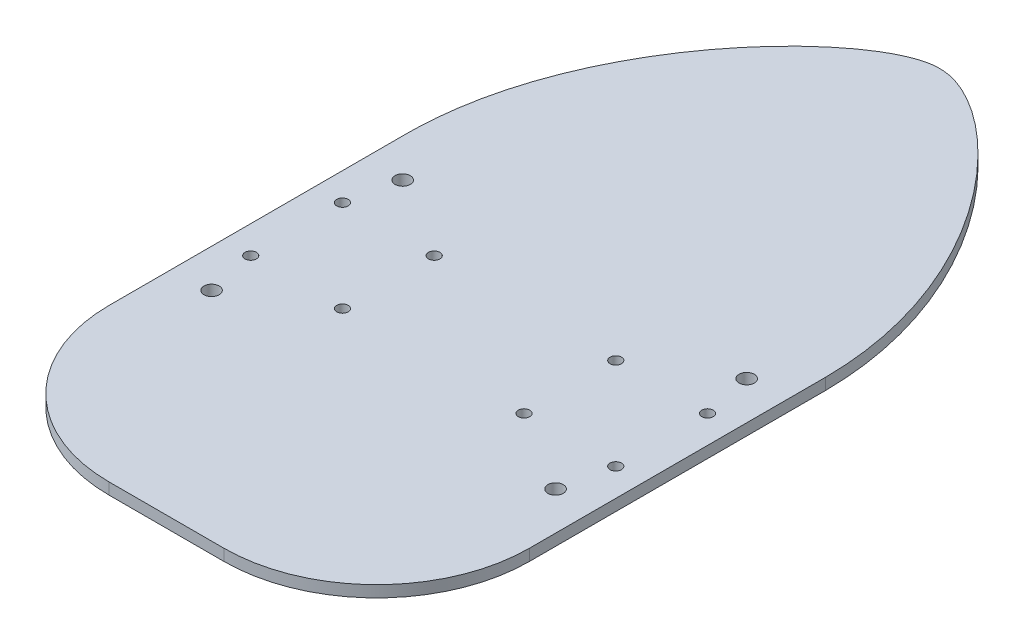
ISO-10303-21;
HEADER;
FILE_DESCRIPTION(('STEP AP214'),'2;1');
FILE_NAME('part.step','',(''),(''),'','','');
FILE_SCHEMA(('AUTOMOTIVE_DESIGN { 1 0 10303 214 1 1 1 1 }'));
ENDSEC;
DATA;
#1=APPLICATION_CONTEXT('core data for automotive mechanical design processes');
#2=APPLICATION_PROTOCOL_DEFINITION('international standard','automotive_design',2000,#1);
#3=PRODUCT_CONTEXT('',#1,'mechanical');
#4=PRODUCT('Part','Part','',(#3));
#5=PRODUCT_RELATED_PRODUCT_CATEGORY('part','',(#4));
#6=PRODUCT_DEFINITION_FORMATION('','',#4);
#7=PRODUCT_DEFINITION_CONTEXT('part definition',#1,'design');
#8=PRODUCT_DEFINITION('design','',#6,#7);
#9=PRODUCT_DEFINITION_SHAPE('','',#8);
#10=(LENGTH_UNIT() NAMED_UNIT(*) SI_UNIT(.MILLI.,.METRE.));
#11=(NAMED_UNIT(*) PLANE_ANGLE_UNIT() SI_UNIT($,.RADIAN.));
#12=(NAMED_UNIT(*) SI_UNIT($,.STERADIAN.) SOLID_ANGLE_UNIT());
#13=UNCERTAINTY_MEASURE_WITH_UNIT(LENGTH_MEASURE(1.E-05),#10,'distance_accuracy_value','');
#14=(GEOMETRIC_REPRESENTATION_CONTEXT(3) GLOBAL_UNCERTAINTY_ASSIGNED_CONTEXT((#13)) GLOBAL_UNIT_ASSIGNED_CONTEXT((#10,
#11,#12)) REPRESENTATION_CONTEXT('',''));
#15=CARTESIAN_POINT('',(0.,0.,0.));
#16=DIRECTION('',(0.,0.,1.));
#17=DIRECTION('',(1.,0.,0.));
#18=AXIS2_PLACEMENT_3D('',#15,#16,#17);
#19=CARTESIAN_POINT('',(-3.00000000000007,-7.42226979040567,-223.6));
#20=DIRECTION('',(-1.,0.,0.));
#21=DIRECTION('',(0.,0.,1.));
#22=AXIS2_PLACEMENT_3D('',#19,#20,#21);
#23=PLANE('',#22);
#24=DIRECTION('',(0.,-1.,0.));
#25=VECTOR('',#24,1.);
#26=CARTESIAN_POINT('',(-3.00000000000007,-7.42226979040567,-60.));
#27=LINE('',#26,#25);
#28=CARTESIAN_POINT('',(-3.00000000000007,-7.42226979040567,-60.));
#29=VERTEX_POINT('',#28);
#30=CARTESIAN_POINT('',(-3.00000000000007,-10.4222697904057,-60.));
#31=VERTEX_POINT('',#30);
#32=EDGE_CURVE('E119',#29,#31,#27,.T.);
#33=ORIENTED_EDGE('',*,*,#32,.T.);
#34=DIRECTION('',(0.,0.,1.));
#35=VECTOR('',#34,1.);
#36=CARTESIAN_POINT('',(-3.00000000000007,-10.4222697904057,-223.6));
#37=LINE('',#36,#35);
#38=CARTESIAN_POINT('',(-3.00000000000007,-10.4222697904057,-137.451520334084));
#39=VERTEX_POINT('',#38);
#40=EDGE_CURVE('E158',#39,#31,#37,.T.);
#41=ORIENTED_EDGE('',*,*,#40,.F.);
#42=DIRECTION('',(0.,-1.,0.));
#43=VECTOR('',#42,1.);
#44=CARTESIAN_POINT('',(-3.00000000000007,-7.42226979040567,-137.451520334084));
#45=LINE('',#44,#43);
#46=CARTESIAN_POINT('',(-3.00000000000007,-7.42226979040567,-137.451520334084));
#47=VERTEX_POINT('',#46);
#48=EDGE_CURVE('E129',#47,#39,#45,.T.);
#49=ORIENTED_EDGE('',*,*,#48,.F.);
#50=DIRECTION('',(0.,0.,1.));
#51=VECTOR('',#50,1.);
#52=CARTESIAN_POINT('',(-3.00000000000007,-7.42226979040567,-223.6));
#53=LINE('',#52,#51);
#54=EDGE_CURVE('E42',#47,#29,#53,.T.);
#55=ORIENTED_EDGE('',*,*,#54,.T.);
#56=EDGE_LOOP('',(#33,#41,#49,#55));
#57=FACE_BOUND('',#56,.T.);
#58=ADVANCED_FACE('F34',(#57),#23,.F.);
#59=CARTESIAN_POINT('',(-3.00000000000007,-7.42226979040567,-223.6));
#60=DIRECTION('',(0.,1.,0.));
#61=DIRECTION('',(-1.,0.,0.));
#62=AXIS2_PLACEMENT_3D('',#59,#60,#61);
#63=PLANE('',#62);
#64=CARTESIAN_POINT('',(-105.75,-7.42226979040567,-89.7999999999999));
#65=DIRECTION('',(0.,-1.,0.));
#66=DIRECTION('',(0.,0.,-1.));
#67=AXIS2_PLACEMENT_3D('',#64,#65,#66);
#68=CIRCLE('',#67,1.5);
#69=CARTESIAN_POINT('',(-105.75,-7.42226979040567,-91.2999999999999));
#70=VERTEX_POINT('',#69);
#71=EDGE_CURVE('E227',#70,#70,#68,.T.);
#72=ORIENTED_EDGE('',*,*,#71,.T.);
#73=EDGE_LOOP('',(#72));
#74=FACE_BOUND('',#73,.T.);
#75=CARTESIAN_POINT('',(-105.75,-7.42226979040567,-113.8));
#76=DIRECTION('',(0.,-1.,0.));
#77=DIRECTION('',(0.,0.,-1.));
#78=AXIS2_PLACEMENT_3D('',#75,#76,#77);
#79=CIRCLE('',#78,1.5);
#80=CARTESIAN_POINT('',(-105.75,-7.42226979040567,-115.3));
#81=VERTEX_POINT('',#80);
#82=EDGE_CURVE('E237',#81,#81,#79,.T.);
#83=ORIENTED_EDGE('',*,*,#82,.T.);
#84=EDGE_LOOP('',(#83));
#85=FACE_BOUND('',#84,.T.);
#86=CARTESIAN_POINT('',(-81.7500000000001,-7.42226979040567,-113.8));
#87=DIRECTION('',(0.,-1.,0.));
#88=DIRECTION('',(0.,0.,-1.));
#89=AXIS2_PLACEMENT_3D('',#86,#87,#88);
#90=CIRCLE('',#89,1.5);
#91=CARTESIAN_POINT('',(-81.7500000000001,-7.42226979040567,-115.3));
#92=VERTEX_POINT('',#91);
#93=EDGE_CURVE('E243',#92,#92,#90,.T.);
#94=ORIENTED_EDGE('',*,*,#93,.T.);
#95=EDGE_LOOP('',(#94));
#96=FACE_BOUND('',#95,.T.);
#97=CARTESIAN_POINT('',(-81.75,-7.42226979040567,-89.8));
#98=DIRECTION('',(0.,-1.,0.));
#99=DIRECTION('',(0.,0.,-1.));
#100=AXIS2_PLACEMENT_3D('',#97,#98,#99);
#101=CIRCLE('',#100,1.5);
#102=CARTESIAN_POINT('',(-81.75,-7.42226979040567,-91.3));
#103=VERTEX_POINT('',#102);
#104=EDGE_CURVE('E249',#103,#103,#101,.T.);
#105=ORIENTED_EDGE('',*,*,#104,.T.);
#106=EDGE_LOOP('',(#105));
#107=FACE_BOUND('',#106,.T.);
#108=CARTESIAN_POINT('',(-34.25,-7.42226979040567,-89.7999999999999));
#109=DIRECTION('',(0.,-1.,0.));
#110=DIRECTION('',(0.,0.,-1.));
#111=AXIS2_PLACEMENT_3D('',#108,#109,#110);
#112=CIRCLE('',#111,1.5);
#113=CARTESIAN_POINT('',(-34.25,-7.42226979040567,-91.2999999999999));
#114=VERTEX_POINT('',#113);
#115=EDGE_CURVE('E255',#114,#114,#112,.T.);
#116=ORIENTED_EDGE('',*,*,#115,.T.);
#117=EDGE_LOOP('',(#116));
#118=FACE_BOUND('',#117,.T.);
#119=CARTESIAN_POINT('',(-34.25,-7.42226979040567,-113.8));
#120=DIRECTION('',(0.,-1.,0.));
#121=DIRECTION('',(0.,0.,-1.));
#122=AXIS2_PLACEMENT_3D('',#119,#120,#121);
#123=CIRCLE('',#122,1.5);
#124=CARTESIAN_POINT('',(-34.25,-7.42226979040567,-115.3));
#125=VERTEX_POINT('',#124);
#126=EDGE_CURVE('E261',#125,#125,#123,.T.);
#127=ORIENTED_EDGE('',*,*,#126,.T.);
#128=EDGE_LOOP('',(#127));
#129=FACE_BOUND('',#128,.T.);
#130=CARTESIAN_POINT('',(-10.25,-7.42226979040567,-113.8));
#131=DIRECTION('',(0.,-1.,0.));
#132=DIRECTION('',(0.,0.,-1.));
#133=AXIS2_PLACEMENT_3D('',#130,#131,#132);
#134=CIRCLE('',#133,1.5);
#135=CARTESIAN_POINT('',(-10.25,-7.42226979040567,-115.3));
#136=VERTEX_POINT('',#135);
#137=EDGE_CURVE('E267',#136,#136,#134,.T.);
#138=ORIENTED_EDGE('',*,*,#137,.T.);
#139=EDGE_LOOP('',(#138));
#140=FACE_BOUND('',#139,.T.);
#141=CARTESIAN_POINT('',(-10.25,-7.42226979040567,-89.7999999999999));
#142=DIRECTION('',(0.,-1.,0.));
#143=DIRECTION('',(0.,0.,-1.));
#144=AXIS2_PLACEMENT_3D('',#141,#142,#143);
#145=CIRCLE('',#144,1.5);
#146=CARTESIAN_POINT('',(-10.25,-7.42226979040567,-91.2999999999999));
#147=VERTEX_POINT('',#146);
#148=EDGE_CURVE('E273',#147,#147,#145,.T.);
#149=ORIENTED_EDGE('',*,*,#148,.T.);
#150=EDGE_LOOP('',(#149));
#151=FACE_BOUND('',#150,.T.);
#152=CARTESIAN_POINT('',(-103.,-7.42226979040567,-76.8));
#153=DIRECTION('',(0.,-1.,0.));
#154=DIRECTION('',(1.,0.,0.));
#155=AXIS2_PLACEMENT_3D('',#152,#153,#154);
#156=CIRCLE('',#155,2.);
#157=CARTESIAN_POINT('',(-101.,-7.42226979040567,-76.8));
#158=VERTEX_POINT('',#157);
#159=EDGE_CURVE('E277',#158,#158,#156,.T.);
#160=ORIENTED_EDGE('',*,*,#159,.T.);
#161=EDGE_LOOP('',(#160));
#162=FACE_BOUND('',#161,.T.);
#163=CARTESIAN_POINT('',(-103.,-7.42226979040567,-126.8));
#164=DIRECTION('',(0.,-1.,0.));
#165=DIRECTION('',(1.,0.,0.));
#166=AXIS2_PLACEMENT_3D('',#163,#164,#165);
#167=CIRCLE('',#166,2.);
#168=CARTESIAN_POINT('',(-101.,-7.42226979040567,-126.8));
#169=VERTEX_POINT('',#168);
#170=EDGE_CURVE('E283',#169,#169,#167,.T.);
#171=ORIENTED_EDGE('',*,*,#170,.T.);
#172=EDGE_LOOP('',(#171));
#173=FACE_BOUND('',#172,.T.);
#174=CARTESIAN_POINT('',(-13.0000000000001,-7.42226979040567,-76.8));
#175=DIRECTION('',(0.,-1.,0.));
#176=DIRECTION('',(1.,0.,0.));
#177=AXIS2_PLACEMENT_3D('',#174,#175,#176);
#178=CIRCLE('',#177,1.99999999999999);
#179=CARTESIAN_POINT('',(-11.0000000000001,-7.42226979040567,-76.8));
#180=VERTEX_POINT('',#179);
#181=EDGE_CURVE('E289',#180,#180,#178,.T.);
#182=ORIENTED_EDGE('',*,*,#181,.T.);
#183=EDGE_LOOP('',(#182));
#184=FACE_BOUND('',#183,.T.);
#185=CARTESIAN_POINT('',(-13.0000000000001,-7.42226979040567,-126.8));
#186=DIRECTION('',(0.,-1.,0.));
#187=DIRECTION('',(1.,0.,0.));
#188=AXIS2_PLACEMENT_3D('',#185,#186,#187);
#189=CIRCLE('',#188,2.);
#190=CARTESIAN_POINT('',(-11.0000000000001,-7.42226979040567,-126.8));
#191=VERTEX_POINT('',#190);
#192=EDGE_CURVE('E117',#191,#191,#189,.T.);
#193=ORIENTED_EDGE('',*,*,#192,.T.);
#194=EDGE_LOOP('',(#193));
#195=FACE_BOUND('',#194,.T.);
#196=CARTESIAN_POINT('',(-43.0000000000001,-7.42226979040567,-60.));
#197=DIRECTION('',(0.,1.,0.));
#198=DIRECTION('',(0.,0.,1.));
#199=AXIS2_PLACEMENT_3D('',#196,#197,#198);
#200=CIRCLE('',#199,40.);
#201=CARTESIAN_POINT('',(-43.0000000000001,-7.42226979040567,-20.));
#202=VERTEX_POINT('',#201);
#203=EDGE_CURVE('E101',#202,#29,#200,.T.);
#204=ORIENTED_EDGE('',*,*,#203,.T.);
#205=ORIENTED_EDGE('',*,*,#54,.F.);
#206=CARTESIAN_POINT('',(-3.00000000000007,-7.42226979040567,-137.451520334084));
#207=CARTESIAN_POINT('',(-3.21725635130087,-7.42226979040567,-179.540007850967));
#208=CARTESIAN_POINT('',(-41.7446100683697,-7.42226979040567,-222.771946497343));
#209=CARTESIAN_POINT('',(-74.5209216481711,-7.42226979040567,-222.568263147561));
#210=CARTESIAN_POINT('',(-113.105106493995,-7.42226979040567,-179.634228921869));
#211=CARTESIAN_POINT('',(-113.,-7.42226979040567,-137.451520334084));
#212=B_SPLINE_CURVE_WITH_KNOTS('',3,(#206,#207,#208,#209,#210,#211),.UNSPECIFIED.,.F.,.F.,(4,1,
1,4),(0.,0.44709103289367,0.54709103289367,1.),.UNSPECIFIED.);
#213=CARTESIAN_POINT('',(-113.000000023422,-7.42226979040567,-137.87139111549));
#214=VERTEX_POINT('',#213);
#215=EDGE_CURVE('E124',#47,#214,#212,.T.);
#216=ORIENTED_EDGE('',*,*,#215,.T.);
#217=DIRECTION('',(0.,0.,1.));
#218=VECTOR('',#217,1.);
#219=CARTESIAN_POINT('',(-113.,-7.42226979040568,-223.6));
#220=LINE('',#219,#218);
#221=CARTESIAN_POINT('',(-113.,-7.42226979040568,-60.));
#222=VERTEX_POINT('',#221);
#223=EDGE_CURVE('E106',#214,#222,#220,.T.);
#224=ORIENTED_EDGE('',*,*,#223,.T.);
#225=CARTESIAN_POINT('',(-73.0000000000001,-7.42226979040567,-60.));
#226=DIRECTION('',(0.,1.,0.));
#227=DIRECTION('',(0.,0.,1.));
#228=AXIS2_PLACEMENT_3D('',#225,#226,#227);
#229=CIRCLE('',#228,40.);
#230=CARTESIAN_POINT('',(-73.0000000000001,-7.42226979040567,-20.));
#231=VERTEX_POINT('',#230);
#232=EDGE_CURVE('E49',#222,#231,#229,.T.);
#233=ORIENTED_EDGE('',*,*,#232,.T.);
#234=DIRECTION('',(1.,0.,0.));
#235=VECTOR('',#234,1.);
#236=CARTESIAN_POINT('',(-73.0000000000001,-7.42226979040567,-20.));
#237=LINE('',#236,#235);
#238=EDGE_CURVE('E96',#231,#202,#237,.T.);
#239=ORIENTED_EDGE('',*,*,#238,.T.);
#240=EDGE_LOOP('',(#204,#205,#216,#224,#233,#239));
#241=FACE_BOUND('',#240,.T.);
#242=ADVANCED_FACE('F36',(#74,#85,#96,#107,#118,#129,#140,#151,#162,#173,#184,#195,#241),#63,.T.);
#243=CARTESIAN_POINT('',(-3.00000000000007,-10.4222697904057,-223.6));
#244=DIRECTION('',(0.,1.,0.));
#245=DIRECTION('',(-1.,0.,0.));
#246=AXIS2_PLACEMENT_3D('',#243,#244,#245);
#247=PLANE('',#246);
#248=CARTESIAN_POINT('',(-105.75,-10.4222697904057,-89.7999999999999));
#249=DIRECTION('',(0.,-1.,0.));
#250=DIRECTION('',(0.,0.,-1.));
#251=AXIS2_PLACEMENT_3D('',#248,#249,#250);
#252=CIRCLE('',#251,1.49999999999999);
#253=CARTESIAN_POINT('',(-105.75,-10.4222697904057,-91.2999999999999));
#254=VERTEX_POINT('',#253);
#255=EDGE_CURVE('E230',#254,#254,#252,.T.);
#256=ORIENTED_EDGE('',*,*,#255,.F.);
#257=EDGE_LOOP('',(#256));
#258=FACE_BOUND('',#257,.T.);
#259=CARTESIAN_POINT('',(-105.75,-10.4222697904057,-113.8));
#260=DIRECTION('',(0.,-1.,0.));
#261=DIRECTION('',(0.,0.,-1.));
#262=AXIS2_PLACEMENT_3D('',#259,#260,#261);
#263=CIRCLE('',#262,1.49999999999999);
#264=CARTESIAN_POINT('',(-105.75,-10.4222697904057,-115.3));
#265=VERTEX_POINT('',#264);
#266=EDGE_CURVE('E232',#265,#265,#263,.T.);
#267=ORIENTED_EDGE('',*,*,#266,.F.);
#268=EDGE_LOOP('',(#267));
#269=FACE_BOUND('',#268,.T.);
#270=CARTESIAN_POINT('',(-81.7500000000001,-10.4222697904057,-113.8));
#271=DIRECTION('',(0.,-1.,0.));
#272=DIRECTION('',(0.,0.,-1.));
#273=AXIS2_PLACEMENT_3D('',#270,#271,#272);
#274=CIRCLE('',#273,1.49999999999999);
#275=CARTESIAN_POINT('',(-81.7500000000001,-10.4222697904057,-115.3));
#276=VERTEX_POINT('',#275);
#277=EDGE_CURVE('E240',#276,#276,#274,.T.);
#278=ORIENTED_EDGE('',*,*,#277,.F.);
#279=EDGE_LOOP('',(#278));
#280=FACE_BOUND('',#279,.T.);
#281=CARTESIAN_POINT('',(-81.75,-10.4222697904057,-89.8));
#282=DIRECTION('',(0.,-1.,0.));
#283=DIRECTION('',(0.,0.,-1.));
#284=AXIS2_PLACEMENT_3D('',#281,#282,#283);
#285=CIRCLE('',#284,1.49999999999999);
#286=CARTESIAN_POINT('',(-81.75,-10.4222697904057,-91.2999999999999));
#287=VERTEX_POINT('',#286);
#288=EDGE_CURVE('E246',#287,#287,#285,.T.);
#289=ORIENTED_EDGE('',*,*,#288,.F.);
#290=EDGE_LOOP('',(#289));
#291=FACE_BOUND('',#290,.T.);
#292=CARTESIAN_POINT('',(-34.25,-10.4222697904057,-89.7999999999999));
#293=DIRECTION('',(0.,-1.,0.));
#294=DIRECTION('',(0.,0.,-1.));
#295=AXIS2_PLACEMENT_3D('',#292,#293,#294);
#296=CIRCLE('',#295,1.49999999999999);
#297=CARTESIAN_POINT('',(-34.25,-10.4222697904057,-91.2999999999999));
#298=VERTEX_POINT('',#297);
#299=EDGE_CURVE('E252',#298,#298,#296,.T.);
#300=ORIENTED_EDGE('',*,*,#299,.F.);
#301=EDGE_LOOP('',(#300));
#302=FACE_BOUND('',#301,.T.);
#303=CARTESIAN_POINT('',(-34.25,-10.4222697904057,-113.8));
#304=DIRECTION('',(0.,-1.,0.));
#305=DIRECTION('',(0.,0.,-1.));
#306=AXIS2_PLACEMENT_3D('',#303,#304,#305);
#307=CIRCLE('',#306,1.49999999999999);
#308=CARTESIAN_POINT('',(-34.25,-10.4222697904057,-115.3));
#309=VERTEX_POINT('',#308);
#310=EDGE_CURVE('E258',#309,#309,#307,.T.);
#311=ORIENTED_EDGE('',*,*,#310,.F.);
#312=EDGE_LOOP('',(#311));
#313=FACE_BOUND('',#312,.T.);
#314=CARTESIAN_POINT('',(-10.25,-10.4222697904057,-113.8));
#315=DIRECTION('',(0.,-1.,0.));
#316=DIRECTION('',(0.,0.,-1.));
#317=AXIS2_PLACEMENT_3D('',#314,#315,#316);
#318=CIRCLE('',#317,1.49999999999999);
#319=CARTESIAN_POINT('',(-10.25,-10.4222697904057,-115.3));
#320=VERTEX_POINT('',#319);
#321=EDGE_CURVE('E264',#320,#320,#318,.T.);
#322=ORIENTED_EDGE('',*,*,#321,.F.);
#323=EDGE_LOOP('',(#322));
#324=FACE_BOUND('',#323,.T.);
#325=CARTESIAN_POINT('',(-10.25,-10.4222697904057,-89.7999999999999));
#326=DIRECTION('',(0.,-1.,0.));
#327=DIRECTION('',(0.,0.,-1.));
#328=AXIS2_PLACEMENT_3D('',#325,#326,#327);
#329=CIRCLE('',#328,1.49999999999999);
#330=CARTESIAN_POINT('',(-10.25,-10.4222697904057,-91.2999999999999));
#331=VERTEX_POINT('',#330);
#332=EDGE_CURVE('E270',#331,#331,#329,.T.);
#333=ORIENTED_EDGE('',*,*,#332,.F.);
#334=EDGE_LOOP('',(#333));
#335=FACE_BOUND('',#334,.T.);
#336=CARTESIAN_POINT('',(-103.,-10.4222697904057,-76.8));
#337=DIRECTION('',(0.,-1.,0.));
#338=DIRECTION('',(1.,0.,0.));
#339=AXIS2_PLACEMENT_3D('',#336,#337,#338);
#340=CIRCLE('',#339,2.);
#341=CARTESIAN_POINT('',(-101.,-10.4222697904057,-76.8));
#342=VERTEX_POINT('',#341);
#343=EDGE_CURVE('E276',#342,#342,#340,.T.);
#344=ORIENTED_EDGE('',*,*,#343,.F.);
#345=EDGE_LOOP('',(#344));
#346=FACE_BOUND('',#345,.T.);
#347=CARTESIAN_POINT('',(-103.,-10.4222697904057,-126.8));
#348=DIRECTION('',(0.,-1.,0.));
#349=DIRECTION('',(1.,0.,0.));
#350=AXIS2_PLACEMENT_3D('',#347,#348,#349);
#351=CIRCLE('',#350,2.);
#352=CARTESIAN_POINT('',(-101.,-10.4222697904057,-126.8));
#353=VERTEX_POINT('',#352);
#354=EDGE_CURVE('E280',#353,#353,#351,.T.);
#355=ORIENTED_EDGE('',*,*,#354,.F.);
#356=EDGE_LOOP('',(#355));
#357=FACE_BOUND('',#356,.T.);
#358=CARTESIAN_POINT('',(-13.0000000000001,-10.4222697904057,-76.8));
#359=DIRECTION('',(0.,-1.,0.));
#360=DIRECTION('',(1.,0.,0.));
#361=AXIS2_PLACEMENT_3D('',#358,#359,#360);
#362=CIRCLE('',#361,1.99999999999999);
#363=CARTESIAN_POINT('',(-11.0000000000001,-10.4222697904057,-76.8));
#364=VERTEX_POINT('',#363);
#365=EDGE_CURVE('E286',#364,#364,#362,.T.);
#366=ORIENTED_EDGE('',*,*,#365,.F.);
#367=EDGE_LOOP('',(#366));
#368=FACE_BOUND('',#367,.T.);
#369=CARTESIAN_POINT('',(-13.0000000000001,-10.4222697904057,-126.8));
#370=DIRECTION('',(0.,-1.,0.));
#371=DIRECTION('',(1.,0.,0.));
#372=AXIS2_PLACEMENT_3D('',#369,#370,#371);
#373=CIRCLE('',#372,2.);
#374=CARTESIAN_POINT('',(-11.0000000000001,-10.4222697904057,-126.8));
#375=VERTEX_POINT('',#374);
#376=EDGE_CURVE('E112',#375,#375,#373,.T.);
#377=ORIENTED_EDGE('',*,*,#376,.F.);
#378=EDGE_LOOP('',(#377));
#379=FACE_BOUND('',#378,.T.);
#380=ORIENTED_EDGE('',*,*,#40,.T.);
#381=CARTESIAN_POINT('',(-43.0000000000001,-10.4222697904057,-60.));
#382=DIRECTION('',(0.,1.,0.));
#383=DIRECTION('',(0.,0.,1.));
#384=AXIS2_PLACEMENT_3D('',#381,#382,#383);
#385=CIRCLE('',#384,40.);
#386=CARTESIAN_POINT('',(-43.0000000000001,-10.4222697904057,-20.));
#387=VERTEX_POINT('',#386);
#388=EDGE_CURVE('E107',#387,#31,#385,.T.);
#389=ORIENTED_EDGE('',*,*,#388,.F.);
#390=DIRECTION('',(1.,0.,0.));
#391=VECTOR('',#390,1.);
#392=CARTESIAN_POINT('',(-73.0000000000001,-10.4222697904057,-20.));
#393=LINE('',#392,#391);
#394=CARTESIAN_POINT('',(-73.0000000000001,-10.4222697904057,-20.));
#395=VERTEX_POINT('',#394);
#396=EDGE_CURVE('E109',#395,#387,#393,.T.);
#397=ORIENTED_EDGE('',*,*,#396,.F.);
#398=CARTESIAN_POINT('',(-73.0000000000001,-10.4222697904057,-60.));
#399=DIRECTION('',(0.,1.,0.));
#400=DIRECTION('',(0.,0.,1.));
#401=AXIS2_PLACEMENT_3D('',#398,#399,#400);
#402=CIRCLE('',#401,40.);
#403=CARTESIAN_POINT('',(-113.,-10.4222697904057,-60.));
#404=VERTEX_POINT('',#403);
#405=EDGE_CURVE('E88',#404,#395,#402,.T.);
#406=ORIENTED_EDGE('',*,*,#405,.F.);
#407=DIRECTION('',(0.,0.,1.));
#408=VECTOR('',#407,1.);
#409=CARTESIAN_POINT('',(-113.,-10.4222697904057,-223.6));
#410=LINE('',#409,#408);
#411=CARTESIAN_POINT('',(-113.,-10.4222697904057,-137.87139111546));
#412=VERTEX_POINT('',#411);
#413=EDGE_CURVE('E156',#412,#404,#410,.T.);
#414=ORIENTED_EDGE('',*,*,#413,.F.);
#415=CARTESIAN_POINT('',(-3.00000000000007,-10.4222697904057,-137.451520334084));
#416=CARTESIAN_POINT('',(-3.21725635130087,-10.4222697904057,-179.540007850967));
#417=CARTESIAN_POINT('',(-41.7446100683697,-10.4222697904057,-222.771946497343));
#418=CARTESIAN_POINT('',(-74.5209216481711,-10.4222697904057,-222.568263147561));
#419=CARTESIAN_POINT('',(-113.105106493995,-10.4222697904057,-179.634228921869));
#420=CARTESIAN_POINT('',(-113.,-10.4222697904057,-137.451520334084));
#421=B_SPLINE_CURVE_WITH_KNOTS('',3,(#415,#416,#417,#418,#419,#420),.UNSPECIFIED.,.F.,.F.,(4,1,
1,4),(0.,0.44709103289367,0.54709103289367,1.),.UNSPECIFIED.);
#422=EDGE_CURVE('E57',#39,#412,#421,.T.);
#423=ORIENTED_EDGE('',*,*,#422,.F.);
#424=EDGE_LOOP('',(#380,#389,#397,#406,#414,#423));
#425=FACE_BOUND('',#424,.T.);
#426=ADVANCED_FACE('F147',(#258,#269,#280,#291,#302,#313,#324,#335,#346,#357,#368,#379,#425),
#247,.F.);
#427=CARTESIAN_POINT('',(-113.,-10.4222697904057,-223.6));
#428=DIRECTION('',(1.,0.,0.));
#429=DIRECTION('',(0.,0.,-1.));
#430=AXIS2_PLACEMENT_3D('',#427,#428,#429);
#431=PLANE('',#430);
#432=ORIENTED_EDGE('',*,*,#413,.T.);
#433=DIRECTION('',(0.,-1.,0.));
#434=VECTOR('',#433,1.);
#435=CARTESIAN_POINT('',(-113.,-7.42226979040567,-60.));
#436=LINE('',#435,#434);
#437=EDGE_CURVE('E93',#222,#404,#436,.T.);
#438=ORIENTED_EDGE('',*,*,#437,.F.);
#439=ORIENTED_EDGE('',*,*,#223,.F.);
#440=DIRECTION('',(0.,-1.,0.));
#441=VECTOR('',#440,1.);
#442=CARTESIAN_POINT('',(-113.,-7.42226979040567,-137.87140052026));
#443=LINE('',#442,#441);
#444=EDGE_CURVE('E11',#214,#412,#443,.T.);
#445=ORIENTED_EDGE('',*,*,#444,.T.);
#446=EDGE_LOOP('',(#432,#438,#439,#445));
#447=FACE_BOUND('',#446,.T.);
#448=ADVANCED_FACE('F142',(#447),#431,.F.);
#449=DIRECTION('',(0.,-1.,0.));
#450=VECTOR('',#449,1.);
#451=SURFACE_OF_LINEAR_EXTRUSION('',#212,#450);
#452=ORIENTED_EDGE('',*,*,#215,.F.);
#453=ORIENTED_EDGE('',*,*,#48,.T.);
#454=ORIENTED_EDGE('',*,*,#422,.T.);
#455=ORIENTED_EDGE('',*,*,#444,.F.);
#456=EDGE_LOOP('',(#452,#453,#454,#455));
#457=FACE_BOUND('',#456,.T.);
#458=ADVANCED_FACE('F137',(#457),#451,.F.);
#459=CARTESIAN_POINT('',(-43.0000000000001,-7.42226979040567,-60.));
#460=DIRECTION('',(0.,-1.,0.));
#461=DIRECTION('',(0.,0.,-1.));
#462=AXIS2_PLACEMENT_3D('',#459,#460,#461);
#463=CYLINDRICAL_SURFACE('',#462,40.);
#464=ORIENTED_EDGE('',*,*,#388,.T.);
#465=ORIENTED_EDGE('',*,*,#32,.F.);
#466=ORIENTED_EDGE('',*,*,#203,.F.);
#467=DIRECTION('',(0.,-1.,0.));
#468=VECTOR('',#467,1.);
#469=CARTESIAN_POINT('',(-43.0000000000001,-7.42226979040567,-20.));
#470=LINE('',#469,#468);
#471=EDGE_CURVE('E92',#202,#387,#470,.T.);
#472=ORIENTED_EDGE('',*,*,#471,.T.);
#473=EDGE_LOOP('',(#464,#465,#466,#472));
#474=FACE_BOUND('',#473,.T.);
#475=ADVANCED_FACE('F141',(#474),#463,.T.);
#476=CARTESIAN_POINT('',(-73.0000000000001,-7.42226979040567,-20.));
#477=DIRECTION('',(0.,0.,-1.));
#478=DIRECTION('',(-1.,0.,0.));
#479=AXIS2_PLACEMENT_3D('',#476,#477,#478);
#480=PLANE('',#479);
#481=ORIENTED_EDGE('',*,*,#396,.T.);
#482=ORIENTED_EDGE('',*,*,#471,.F.);
#483=ORIENTED_EDGE('',*,*,#238,.F.);
#484=DIRECTION('',(0.,-1.,0.));
#485=VECTOR('',#484,1.);
#486=CARTESIAN_POINT('',(-73.0000000000001,-7.42226979040567,-20.));
#487=LINE('',#486,#485);
#488=EDGE_CURVE('E84',#231,#395,#487,.T.);
#489=ORIENTED_EDGE('',*,*,#488,.T.);
#490=EDGE_LOOP('',(#481,#482,#483,#489));
#491=FACE_BOUND('',#490,.T.);
#492=ADVANCED_FACE('F97',(#491),#480,.F.);
#493=CARTESIAN_POINT('',(-73.0000000000001,-7.42226979040567,-60.));
#494=DIRECTION('',(0.,-1.,0.));
#495=DIRECTION('',(0.,0.,-1.));
#496=AXIS2_PLACEMENT_3D('',#493,#494,#495);
#497=CYLINDRICAL_SURFACE('',#496,40.);
#498=ORIENTED_EDGE('',*,*,#405,.T.);
#499=ORIENTED_EDGE('',*,*,#488,.F.);
#500=ORIENTED_EDGE('',*,*,#232,.F.);
#501=ORIENTED_EDGE('',*,*,#437,.T.);
#502=EDGE_LOOP('',(#498,#499,#500,#501));
#503=FACE_BOUND('',#502,.T.);
#504=ADVANCED_FACE('F86',(#503),#497,.T.);
#505=CARTESIAN_POINT('',(-13.0000000000001,-7.42226979040567,-126.8));
#506=DIRECTION('',(0.,-1.,0.));
#507=DIRECTION('',(1.,0.,0.));
#508=AXIS2_PLACEMENT_3D('',#505,#506,#507);
#509=CYLINDRICAL_SURFACE('',#508,2.);
#510=ORIENTED_EDGE('',*,*,#192,.F.);
#511=EDGE_LOOP('',(#510));
#512=FACE_BOUND('',#511,.T.);
#513=ORIENTED_EDGE('',*,*,#376,.T.);
#514=EDGE_LOOP('',(#513));
#515=FACE_BOUND('',#514,.T.);
#516=ADVANCED_FACE('F175',(#512,#515),#509,.F.);
#517=CARTESIAN_POINT('',(-13.0000000000001,-7.42226979040567,-76.8));
#518=DIRECTION('',(0.,-1.,0.));
#519=DIRECTION('',(1.,0.,0.));
#520=AXIS2_PLACEMENT_3D('',#517,#518,#519);
#521=CYLINDRICAL_SURFACE('',#520,1.99999999999999);
#522=ORIENTED_EDGE('',*,*,#181,.F.);
#523=EDGE_LOOP('',(#522));
#524=FACE_BOUND('',#523,.T.);
#525=ORIENTED_EDGE('',*,*,#365,.T.);
#526=EDGE_LOOP('',(#525));
#527=FACE_BOUND('',#526,.T.);
#528=ADVANCED_FACE('F178',(#524,#527),#521,.F.);
#529=CARTESIAN_POINT('',(-103.,-7.42226979040567,-126.8));
#530=DIRECTION('',(0.,-1.,0.));
#531=DIRECTION('',(1.,0.,0.));
#532=AXIS2_PLACEMENT_3D('',#529,#530,#531);
#533=CYLINDRICAL_SURFACE('',#532,2.);
#534=ORIENTED_EDGE('',*,*,#170,.F.);
#535=EDGE_LOOP('',(#534));
#536=FACE_BOUND('',#535,.T.);
#537=ORIENTED_EDGE('',*,*,#354,.T.);
#538=EDGE_LOOP('',(#537));
#539=FACE_BOUND('',#538,.T.);
#540=ADVANCED_FACE('F182',(#536,#539),#533,.F.);
#541=CARTESIAN_POINT('',(-103.,-7.42226979040567,-76.8));
#542=DIRECTION('',(0.,-1.,0.));
#543=DIRECTION('',(1.,0.,0.));
#544=AXIS2_PLACEMENT_3D('',#541,#542,#543);
#545=CYLINDRICAL_SURFACE('',#544,2.);
#546=ORIENTED_EDGE('',*,*,#159,.F.);
#547=EDGE_LOOP('',(#546));
#548=FACE_BOUND('',#547,.T.);
#549=ORIENTED_EDGE('',*,*,#343,.T.);
#550=EDGE_LOOP('',(#549));
#551=FACE_BOUND('',#550,.T.);
#552=ADVANCED_FACE('F186',(#548,#551),#545,.F.);
#553=CARTESIAN_POINT('',(-10.25,-10.4222697904057,-89.7999999999999));
#554=DIRECTION('',(0.,-1.,0.));
#555=DIRECTION('',(0.,0.,-1.));
#556=AXIS2_PLACEMENT_3D('',#553,#554,#555);
#557=CYLINDRICAL_SURFACE('',#556,1.49999999999999);
#558=ORIENTED_EDGE('',*,*,#148,.F.);
#559=EDGE_LOOP('',(#558));
#560=FACE_BOUND('',#559,.T.);
#561=ORIENTED_EDGE('',*,*,#332,.T.);
#562=EDGE_LOOP('',(#561));
#563=FACE_BOUND('',#562,.T.);
#564=ADVANCED_FACE('F190',(#560,#563),#557,.F.);
#565=CARTESIAN_POINT('',(-10.25,-10.4222697904057,-113.8));
#566=DIRECTION('',(0.,-1.,0.));
#567=DIRECTION('',(0.,0.,-1.));
#568=AXIS2_PLACEMENT_3D('',#565,#566,#567);
#569=CYLINDRICAL_SURFACE('',#568,1.49999999999999);
#570=ORIENTED_EDGE('',*,*,#137,.F.);
#571=EDGE_LOOP('',(#570));
#572=FACE_BOUND('',#571,.T.);
#573=ORIENTED_EDGE('',*,*,#321,.T.);
#574=EDGE_LOOP('',(#573));
#575=FACE_BOUND('',#574,.T.);
#576=ADVANCED_FACE('F194',(#572,#575),#569,.F.);
#577=CARTESIAN_POINT('',(-34.25,-10.4222697904057,-113.8));
#578=DIRECTION('',(0.,-1.,0.));
#579=DIRECTION('',(0.,0.,-1.));
#580=AXIS2_PLACEMENT_3D('',#577,#578,#579);
#581=CYLINDRICAL_SURFACE('',#580,1.49999999999999);
#582=ORIENTED_EDGE('',*,*,#126,.F.);
#583=EDGE_LOOP('',(#582));
#584=FACE_BOUND('',#583,.T.);
#585=ORIENTED_EDGE('',*,*,#310,.T.);
#586=EDGE_LOOP('',(#585));
#587=FACE_BOUND('',#586,.T.);
#588=ADVANCED_FACE('F198',(#584,#587),#581,.F.);
#589=CARTESIAN_POINT('',(-34.25,-10.4222697904057,-89.7999999999999));
#590=DIRECTION('',(0.,-1.,0.));
#591=DIRECTION('',(0.,0.,-1.));
#592=AXIS2_PLACEMENT_3D('',#589,#590,#591);
#593=CYLINDRICAL_SURFACE('',#592,1.49999999999999);
#594=ORIENTED_EDGE('',*,*,#115,.F.);
#595=EDGE_LOOP('',(#594));
#596=FACE_BOUND('',#595,.T.);
#597=ORIENTED_EDGE('',*,*,#299,.T.);
#598=EDGE_LOOP('',(#597));
#599=FACE_BOUND('',#598,.T.);
#600=ADVANCED_FACE('F202',(#596,#599),#593,.F.);
#601=CARTESIAN_POINT('',(-81.75,-10.4222697904057,-89.8));
#602=DIRECTION('',(0.,-1.,0.));
#603=DIRECTION('',(0.,0.,-1.));
#604=AXIS2_PLACEMENT_3D('',#601,#602,#603);
#605=CYLINDRICAL_SURFACE('',#604,1.49999999999999);
#606=ORIENTED_EDGE('',*,*,#104,.F.);
#607=EDGE_LOOP('',(#606));
#608=FACE_BOUND('',#607,.T.);
#609=ORIENTED_EDGE('',*,*,#288,.T.);
#610=EDGE_LOOP('',(#609));
#611=FACE_BOUND('',#610,.T.);
#612=ADVANCED_FACE('F206',(#608,#611),#605,.F.);
#613=CARTESIAN_POINT('',(-81.7500000000001,-10.4222697904057,-113.8));
#614=DIRECTION('',(0.,-1.,0.));
#615=DIRECTION('',(0.,0.,-1.));
#616=AXIS2_PLACEMENT_3D('',#613,#614,#615);
#617=CYLINDRICAL_SURFACE('',#616,1.49999999999999);
#618=ORIENTED_EDGE('',*,*,#93,.F.);
#619=EDGE_LOOP('',(#618));
#620=FACE_BOUND('',#619,.T.);
#621=ORIENTED_EDGE('',*,*,#277,.T.);
#622=EDGE_LOOP('',(#621));
#623=FACE_BOUND('',#622,.T.);
#624=ADVANCED_FACE('F210',(#620,#623),#617,.F.);
#625=CARTESIAN_POINT('',(-105.75,-10.4222697904057,-113.8));
#626=DIRECTION('',(0.,-1.,0.));
#627=DIRECTION('',(0.,0.,-1.));
#628=AXIS2_PLACEMENT_3D('',#625,#626,#627);
#629=CYLINDRICAL_SURFACE('',#628,1.49999999999999);
#630=ORIENTED_EDGE('',*,*,#82,.F.);
#631=EDGE_LOOP('',(#630));
#632=FACE_BOUND('',#631,.T.);
#633=ORIENTED_EDGE('',*,*,#266,.T.);
#634=EDGE_LOOP('',(#633));
#635=FACE_BOUND('',#634,.T.);
#636=ADVANCED_FACE('F214',(#632,#635),#629,.F.);
#637=CARTESIAN_POINT('',(-105.75,-10.4222697904057,-89.7999999999999));
#638=DIRECTION('',(0.,-1.,0.));
#639=DIRECTION('',(0.,0.,-1.));
#640=AXIS2_PLACEMENT_3D('',#637,#638,#639);
#641=CYLINDRICAL_SURFACE('',#640,1.49999999999999);
#642=ORIENTED_EDGE('',*,*,#71,.F.);
#643=EDGE_LOOP('',(#642));
#644=FACE_BOUND('',#643,.T.);
#645=ORIENTED_EDGE('',*,*,#255,.T.);
#646=EDGE_LOOP('',(#645));
#647=FACE_BOUND('',#646,.T.);
#648=ADVANCED_FACE('F218',(#644,#647),#641,.F.);
#649=CLOSED_SHELL('',(#58,#242,#426,#448,#458,#475,#492,#504,#516,#528,#540,#552,#564,#576,#588,
#600,#612,#624,#636,#648));
#650=MANIFOLD_SOLID_BREP('B2',#649);
#651=ADVANCED_BREP_SHAPE_REPRESENTATION('',(#18,#650),#14);
#652=SHAPE_DEFINITION_REPRESENTATION(#9,#651);
ENDSEC;
END-ISO-10303-21;
